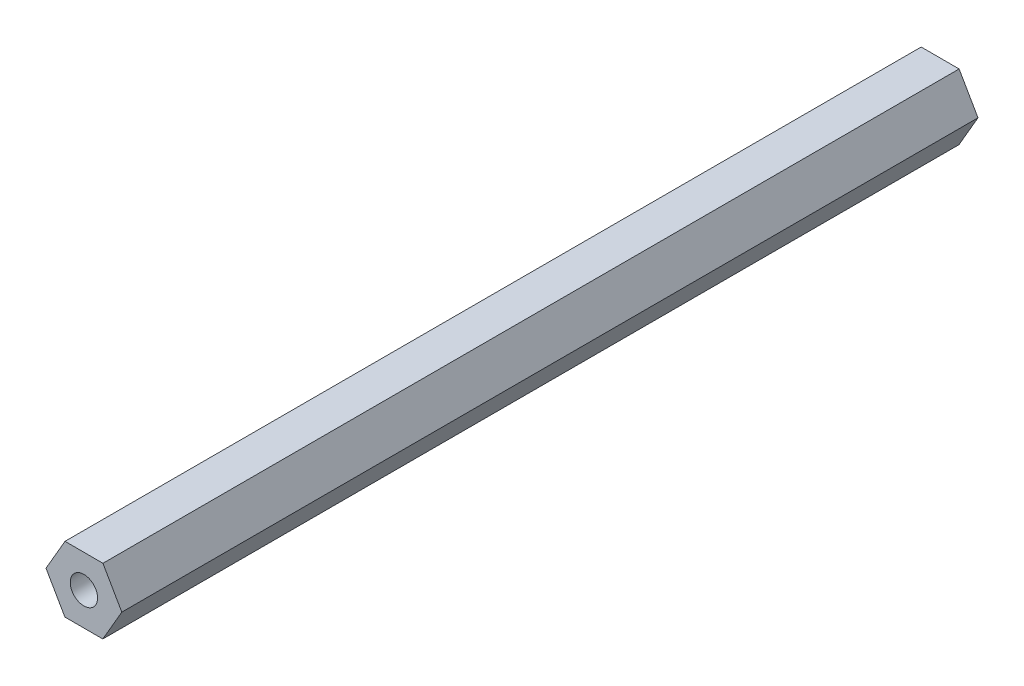
ISO-10303-21;
HEADER;
FILE_DESCRIPTION(('STEP AP214'),'2;1');
FILE_NAME('part.step','',(''),(''),'','','');
FILE_SCHEMA(('AUTOMOTIVE_DESIGN { 1 0 10303 214 1 1 1 1 }'));
ENDSEC;
DATA;
#1=APPLICATION_CONTEXT('core data for automotive mechanical design processes');
#2=APPLICATION_PROTOCOL_DEFINITION('international standard','automotive_design',2000,#1);
#3=PRODUCT_CONTEXT('',#1,'mechanical');
#4=PRODUCT('Part','Part','',(#3));
#5=PRODUCT_RELATED_PRODUCT_CATEGORY('part','',(#4));
#6=PRODUCT_DEFINITION_FORMATION('','',#4);
#7=PRODUCT_DEFINITION_CONTEXT('part definition',#1,'design');
#8=PRODUCT_DEFINITION('design','',#6,#7);
#9=PRODUCT_DEFINITION_SHAPE('','',#8);
#10=(LENGTH_UNIT() NAMED_UNIT(*) SI_UNIT(.MILLI.,.METRE.));
#11=(NAMED_UNIT(*) PLANE_ANGLE_UNIT() SI_UNIT($,.RADIAN.));
#12=(NAMED_UNIT(*) SI_UNIT($,.STERADIAN.) SOLID_ANGLE_UNIT());
#13=UNCERTAINTY_MEASURE_WITH_UNIT(LENGTH_MEASURE(1.E-05),#10,'distance_accuracy_value','');
#14=(GEOMETRIC_REPRESENTATION_CONTEXT(3) GLOBAL_UNCERTAINTY_ASSIGNED_CONTEXT((#13)) GLOBAL_UNIT_ASSIGNED_CONTEXT((#10,
#11,#12)) REPRESENTATION_CONTEXT('',''));
#15=CARTESIAN_POINT('',(0.,0.,0.));
#16=DIRECTION('',(0.,0.,1.));
#17=DIRECTION('',(1.,0.,0.));
#18=AXIS2_PLACEMENT_3D('',#15,#16,#17);
#19=CARTESIAN_POINT('',(-3.4758056499341,-5.99322743468711,156.5));
#20=DIRECTION('',(0.00195177215035608,0.999998095290923,0.));
#21=DIRECTION('',(-0.999998095290923,0.00195177215035608,0.));
#22=AXIS2_PLACEMENT_3D('',#19,#20,#21);
#23=PLANE('',#22);
#24=DIRECTION('',(0.999998095290923,-0.00195177215035608,0.));
#25=VECTOR('',#24,1.);
#26=CARTESIAN_POINT('',(-3.4758056499341,-5.99322743468711,0.));
#27=LINE('',#26,#25);
#28=CARTESIAN_POINT('',(-3.4758056499341,-5.99322743468711,0.));
#29=VERTEX_POINT('',#28);
#30=CARTESIAN_POINT('',(3.45238438412983,-6.00674970880397,0.));
#31=VERTEX_POINT('',#30);
#32=EDGE_CURVE('E132',#29,#31,#27,.T.);
#33=ORIENTED_EDGE('',*,*,#32,.T.);
#34=DIRECTION('',(0.,0.,-1.));
#35=VECTOR('',#34,1.);
#36=CARTESIAN_POINT('',(3.45238438412983,-6.00674970880397,156.5));
#37=LINE('',#36,#35);
#38=CARTESIAN_POINT('',(3.45238438412983,-6.00674970880397,156.5));
#39=VERTEX_POINT('',#38);
#40=EDGE_CURVE('E11',#39,#31,#37,.T.);
#41=ORIENTED_EDGE('',*,*,#40,.F.);
#42=DIRECTION('',(0.999998095290923,-0.00195177215035608,0.));
#43=VECTOR('',#42,1.);
#44=CARTESIAN_POINT('',(-3.4758056499341,-5.99322743468711,156.5));
#45=LINE('',#44,#43);
#46=CARTESIAN_POINT('',(-3.4758056499341,-5.99322743468711,156.5));
#47=VERTEX_POINT('',#46);
#48=EDGE_CURVE('E143',#47,#39,#45,.T.);
#49=ORIENTED_EDGE('',*,*,#48,.F.);
#50=DIRECTION('',(0.,0.,-1.));
#51=VECTOR('',#50,1.);
#52=CARTESIAN_POINT('',(-3.4758056499341,-5.99322743468711,156.5));
#53=LINE('',#52,#51);
#54=EDGE_CURVE('E128',#47,#29,#53,.T.);
#55=ORIENTED_EDGE('',*,*,#54,.T.);
#56=EDGE_LOOP('',(#33,#41,#49,#55));
#57=FACE_BOUND('',#56,.T.);
#58=ADVANCED_FACE('F45',(#57),#23,.F.);
#59=CARTESIAN_POINT('',(3.45238438412983,-6.00674970880397,156.5));
#60=DIRECTION('',(-0.865047868182813,0.501689331910069,0.));
#61=DIRECTION('',(-0.501689331910069,-0.865047868182813,0.));
#62=AXIS2_PLACEMENT_3D('',#59,#60,#61);
#63=PLANE('',#62);
#64=DIRECTION('',(0.501689331910069,0.865047868182813,0.));
#65=VECTOR('',#64,1.);
#66=CARTESIAN_POINT('',(3.45238438412983,-6.00674970880397,0.));
#67=LINE('',#66,#65);
#68=CARTESIAN_POINT('',(6.92819003406393,-0.0135222741168591,0.));
#69=VERTEX_POINT('',#68);
#70=EDGE_CURVE('E135',#31,#69,#67,.T.);
#71=ORIENTED_EDGE('',*,*,#70,.T.);
#72=DIRECTION('',(0.,0.,-1.));
#73=VECTOR('',#72,1.);
#74=CARTESIAN_POINT('',(6.92819003406393,-0.0135222741168591,156.5));
#75=LINE('',#74,#73);
#76=CARTESIAN_POINT('',(6.92819003406393,-0.0135222741168591,156.5));
#77=VERTEX_POINT('',#76);
#78=EDGE_CURVE('E53',#77,#69,#75,.T.);
#79=ORIENTED_EDGE('',*,*,#78,.F.);
#80=DIRECTION('',(0.501689331910069,0.865047868182813,0.));
#81=VECTOR('',#80,1.);
#82=CARTESIAN_POINT('',(3.45238438412983,-6.00674970880397,156.5));
#83=LINE('',#82,#81);
#84=EDGE_CURVE('E99',#39,#77,#83,.T.);
#85=ORIENTED_EDGE('',*,*,#84,.F.);
#86=ORIENTED_EDGE('',*,*,#40,.T.);
#87=EDGE_LOOP('',(#71,#79,#85,#86));
#88=FACE_BOUND('',#87,.T.);
#89=ADVANCED_FACE('F168',(#88),#63,.F.);
#90=CARTESIAN_POINT('',(6.92819003406393,-0.0135222741168591,156.5));
#91=DIRECTION('',(-0.866999640333169,-0.498308763380854,0.));
#92=DIRECTION('',(0.498308763380854,-0.866999640333169,0.));
#93=AXIS2_PLACEMENT_3D('',#90,#91,#92);
#94=PLANE('',#93);
#95=DIRECTION('',(-0.498308763380854,0.866999640333169,0.));
#96=VECTOR('',#95,1.);
#97=CARTESIAN_POINT('',(6.92819003406393,-0.0135222741168591,0.));
#98=LINE('',#97,#96);
#99=CARTESIAN_POINT('',(3.4758056499341,5.99322743468711,0.));
#100=VERTEX_POINT('',#99);
#101=EDGE_CURVE('E138',#69,#100,#98,.T.);
#102=ORIENTED_EDGE('',*,*,#101,.T.);
#103=DIRECTION('',(0.,0.,-1.));
#104=VECTOR('',#103,1.);
#105=CARTESIAN_POINT('',(3.4758056499341,5.99322743468711,156.5));
#106=LINE('',#105,#104);
#107=CARTESIAN_POINT('',(3.4758056499341,5.99322743468711,156.5));
#108=VERTEX_POINT('',#107);
#109=EDGE_CURVE('E123',#108,#100,#106,.T.);
#110=ORIENTED_EDGE('',*,*,#109,.F.);
#111=DIRECTION('',(-0.498308763380854,0.866999640333169,0.));
#112=VECTOR('',#111,1.);
#113=CARTESIAN_POINT('',(6.92819003406393,-0.0135222741168591,156.5));
#114=LINE('',#113,#112);
#115=EDGE_CURVE('E114',#77,#108,#114,.T.);
#116=ORIENTED_EDGE('',*,*,#115,.F.);
#117=ORIENTED_EDGE('',*,*,#78,.T.);
#118=EDGE_LOOP('',(#102,#110,#116,#117));
#119=FACE_BOUND('',#118,.T.);
#120=ADVANCED_FACE('F149',(#119),#94,.F.);
#121=CARTESIAN_POINT('',(3.4758056499341,5.99322743468711,156.5));
#122=DIRECTION('',(-0.00195177215035595,-0.999998095290923,0.));
#123=DIRECTION('',(0.999998095290923,-0.00195177215035595,0.));
#124=AXIS2_PLACEMENT_3D('',#121,#122,#123);
#125=PLANE('',#124);
#126=DIRECTION('',(-0.999998095290923,0.00195177215035595,0.));
#127=VECTOR('',#126,1.);
#128=CARTESIAN_POINT('',(3.4758056499341,5.99322743468711,0.));
#129=LINE('',#128,#127);
#130=CARTESIAN_POINT('',(-3.45238438412983,6.00674970880396,0.));
#131=VERTEX_POINT('',#130);
#132=EDGE_CURVE('E122',#100,#131,#129,.T.);
#133=ORIENTED_EDGE('',*,*,#132,.T.);
#134=DIRECTION('',(0.,0.,-1.));
#135=VECTOR('',#134,1.);
#136=CARTESIAN_POINT('',(-3.45238438412983,6.00674970880396,156.5));
#137=LINE('',#136,#135);
#138=CARTESIAN_POINT('',(-3.45238438412983,6.00674970880396,156.5));
#139=VERTEX_POINT('',#138);
#140=EDGE_CURVE('E119',#139,#131,#137,.T.);
#141=ORIENTED_EDGE('',*,*,#140,.F.);
#142=DIRECTION('',(-0.999998095290923,0.00195177215035595,0.));
#143=VECTOR('',#142,1.);
#144=CARTESIAN_POINT('',(3.4758056499341,5.99322743468711,156.5));
#145=LINE('',#144,#143);
#146=EDGE_CURVE('E108',#108,#139,#145,.T.);
#147=ORIENTED_EDGE('',*,*,#146,.F.);
#148=ORIENTED_EDGE('',*,*,#109,.T.);
#149=EDGE_LOOP('',(#133,#141,#147,#148));
#150=FACE_BOUND('',#149,.T.);
#151=ADVANCED_FACE('F120',(#150),#125,.F.);
#152=CARTESIAN_POINT('',(-3.45238438412983,6.00674970880396,156.5));
#153=DIRECTION('',(0.865047868182813,-0.501689331910069,0.));
#154=DIRECTION('',(0.501689331910069,0.865047868182813,0.));
#155=AXIS2_PLACEMENT_3D('',#152,#153,#154);
#156=PLANE('',#155);
#157=DIRECTION('',(-0.501689331910069,-0.865047868182813,0.));
#158=VECTOR('',#157,1.);
#159=CARTESIAN_POINT('',(-3.45238438412983,6.00674970880396,0.));
#160=LINE('',#159,#158);
#161=CARTESIAN_POINT('',(-6.92819003406393,0.0135222741168588,0.));
#162=VERTEX_POINT('',#161);
#163=EDGE_CURVE('E85',#131,#162,#160,.T.);
#164=ORIENTED_EDGE('',*,*,#163,.T.);
#165=DIRECTION('',(0.,0.,-1.));
#166=VECTOR('',#165,1.);
#167=CARTESIAN_POINT('',(-6.92819003406393,0.0135222741168588,156.5));
#168=LINE('',#167,#166);
#169=CARTESIAN_POINT('',(-6.92819003406393,0.0135222741168588,156.5));
#170=VERTEX_POINT('',#169);
#171=EDGE_CURVE('E124',#170,#162,#168,.T.);
#172=ORIENTED_EDGE('',*,*,#171,.F.);
#173=DIRECTION('',(-0.501689331910069,-0.865047868182813,0.));
#174=VECTOR('',#173,1.);
#175=CARTESIAN_POINT('',(-3.45238438412983,6.00674970880396,156.5));
#176=LINE('',#175,#174);
#177=EDGE_CURVE('E112',#139,#170,#176,.T.);
#178=ORIENTED_EDGE('',*,*,#177,.F.);
#179=ORIENTED_EDGE('',*,*,#140,.T.);
#180=EDGE_LOOP('',(#164,#172,#178,#179));
#181=FACE_BOUND('',#180,.T.);
#182=ADVANCED_FACE('F126',(#181),#156,.F.);
#183=CARTESIAN_POINT('',(-6.92819003406393,0.0135222741168588,156.5));
#184=DIRECTION('',(0.866999640333169,0.498308763380854,0.));
#185=DIRECTION('',(-0.498308763380854,0.866999640333169,0.));
#186=AXIS2_PLACEMENT_3D('',#183,#184,#185);
#187=PLANE('',#186);
#188=DIRECTION('',(0.498308763380854,-0.866999640333169,0.));
#189=VECTOR('',#188,1.);
#190=CARTESIAN_POINT('',(-6.92819003406393,0.0135222741168588,0.));
#191=LINE('',#190,#189);
#192=EDGE_CURVE('E91',#162,#29,#191,.T.);
#193=ORIENTED_EDGE('',*,*,#192,.T.);
#194=ORIENTED_EDGE('',*,*,#54,.F.);
#195=DIRECTION('',(0.498308763380854,-0.866999640333169,0.));
#196=VECTOR('',#195,1.);
#197=CARTESIAN_POINT('',(-6.92819003406393,0.0135222741168588,156.5));
#198=LINE('',#197,#196);
#199=EDGE_CURVE('E61',#170,#47,#198,.T.);
#200=ORIENTED_EDGE('',*,*,#199,.F.);
#201=ORIENTED_EDGE('',*,*,#171,.T.);
#202=EDGE_LOOP('',(#193,#194,#200,#201));
#203=FACE_BOUND('',#202,.T.);
#204=ADVANCED_FACE('F156',(#203),#187,.F.);
#205=CARTESIAN_POINT('',(3.45238438412983,-6.00674970880397,156.5));
#206=DIRECTION('',(0.,0.,1.));
#207=DIRECTION('',(1.,0.,0.));
#208=AXIS2_PLACEMENT_3D('',#205,#206,#207);
#209=PLANE('',#208);
#210=CARTESIAN_POINT('',(0.,0.,156.5));
#211=DIRECTION('',(0.,0.,1.));
#212=DIRECTION('',(1.,0.,0.));
#213=AXIS2_PLACEMENT_3D('',#210,#211,#212);
#214=CIRCLE('',#213,2.49999999999999);
#215=CARTESIAN_POINT('',(2.49999999999999,0.,156.5));
#216=VERTEX_POINT('',#215);
#217=EDGE_CURVE('E256',#216,#216,#214,.T.);
#218=ORIENTED_EDGE('',*,*,#217,.F.);
#219=EDGE_LOOP('',(#218));
#220=FACE_BOUND('',#219,.T.);
#221=ORIENTED_EDGE('',*,*,#48,.T.);
#222=ORIENTED_EDGE('',*,*,#84,.T.);
#223=ORIENTED_EDGE('',*,*,#115,.T.);
#224=ORIENTED_EDGE('',*,*,#146,.T.);
#225=ORIENTED_EDGE('',*,*,#177,.T.);
#226=ORIENTED_EDGE('',*,*,#199,.T.);
#227=EDGE_LOOP('',(#221,#222,#223,#224,#225,#226));
#228=FACE_BOUND('',#227,.T.);
#229=ADVANCED_FACE('F110',(#220,#228),#209,.T.);
#230=CARTESIAN_POINT('',(3.45238438412983,-6.00674970880397,0.));
#231=DIRECTION('',(0.,0.,1.));
#232=DIRECTION('',(1.,0.,0.));
#233=AXIS2_PLACEMENT_3D('',#230,#231,#232);
#234=PLANE('',#233);
#235=CARTESIAN_POINT('',(0.,0.,0.));
#236=DIRECTION('',(0.,0.,-1.));
#237=DIRECTION('',(-1.,0.,0.));
#238=AXIS2_PLACEMENT_3D('',#235,#236,#237);
#239=CIRCLE('',#238,2.49999999999999);
#240=CARTESIAN_POINT('',(-2.49999999999999,0.,0.));
#241=VERTEX_POINT('',#240);
#242=EDGE_CURVE('E254',#241,#241,#239,.T.);
#243=ORIENTED_EDGE('',*,*,#242,.F.);
#244=EDGE_LOOP('',(#243));
#245=FACE_BOUND('',#244,.T.);
#246=ORIENTED_EDGE('',*,*,#32,.F.);
#247=ORIENTED_EDGE('',*,*,#192,.F.);
#248=ORIENTED_EDGE('',*,*,#163,.F.);
#249=ORIENTED_EDGE('',*,*,#132,.F.);
#250=ORIENTED_EDGE('',*,*,#101,.F.);
#251=ORIENTED_EDGE('',*,*,#70,.F.);
#252=EDGE_LOOP('',(#246,#247,#248,#249,#250,#251));
#253=FACE_BOUND('',#252,.T.);
#254=ADVANCED_FACE('F152',(#245,#253),#234,.F.);
#255=CARTESIAN_POINT('',(0.,0.,139.5));
#256=DIRECTION('',(0.,0.,1.));
#257=DIRECTION('',(1.,0.,0.));
#258=AXIS2_PLACEMENT_3D('',#255,#256,#257);
#259=CONICAL_SURFACE('',#258,2.49999999999999,1.02974425867665);
#260=CARTESIAN_POINT('',(0.,0.,137.997848452431));
#261=VERTEX_POINT('',#260);
#262=VERTEX_LOOP('',#261);
#263=FACE_BOUND('',#262,.T.);
#264=CARTESIAN_POINT('',(0.,0.,139.5));
#265=DIRECTION('',(0.,0.,1.));
#266=DIRECTION('',(1.,0.,0.));
#267=AXIS2_PLACEMENT_3D('',#264,#265,#266);
#268=CIRCLE('',#267,2.49999999999999);
#269=CARTESIAN_POINT('',(2.49999999999999,0.,139.5));
#270=VERTEX_POINT('',#269);
#271=EDGE_CURVE('E136',#270,#270,#268,.T.);
#272=ORIENTED_EDGE('',*,*,#271,.T.);
#273=EDGE_LOOP('',(#272));
#274=FACE_BOUND('',#273,.T.);
#275=ADVANCED_FACE('F200',(#263,#274),#259,.F.);
#276=CARTESIAN_POINT('',(0.,0.,156.5));
#277=DIRECTION('',(0.,0.,1.));
#278=DIRECTION('',(1.,0.,0.));
#279=AXIS2_PLACEMENT_3D('',#276,#277,#278);
#280=CYLINDRICAL_SURFACE('',#279,2.49999999999999);
#281=ORIENTED_EDGE('',*,*,#271,.F.);
#282=EDGE_LOOP('',(#281));
#283=FACE_BOUND('',#282,.T.);
#284=ORIENTED_EDGE('',*,*,#217,.T.);
#285=EDGE_LOOP('',(#284));
#286=FACE_BOUND('',#285,.T.);
#287=ADVANCED_FACE('F208',(#283,#286),#280,.F.);
#288=CARTESIAN_POINT('',(0.,0.,17.));
#289=DIRECTION('',(0.,0.,-1.));
#290=DIRECTION('',(-1.,0.,0.));
#291=AXIS2_PLACEMENT_3D('',#288,#289,#290);
#292=CONICAL_SURFACE('',#291,2.49999999999999,1.02974425867665);
#293=CARTESIAN_POINT('',(0.,0.,18.5021515475689));
#294=VERTEX_POINT('',#293);
#295=VERTEX_LOOP('',#294);
#296=FACE_BOUND('',#295,.T.);
#297=CARTESIAN_POINT('',(0.,0.,17.));
#298=DIRECTION('',(0.,0.,-1.));
#299=DIRECTION('',(-1.,0.,0.));
#300=AXIS2_PLACEMENT_3D('',#297,#298,#299);
#301=CIRCLE('',#300,2.49999999999999);
#302=CARTESIAN_POINT('',(-2.49999999999999,0.,17.));
#303=VERTEX_POINT('',#302);
#304=EDGE_CURVE('E251',#303,#303,#301,.T.);
#305=ORIENTED_EDGE('',*,*,#304,.T.);
#306=EDGE_LOOP('',(#305));
#307=FACE_BOUND('',#306,.T.);
#308=ADVANCED_FACE('F216',(#296,#307),#292,.F.);
#309=CARTESIAN_POINT('',(0.,0.,0.));
#310=DIRECTION('',(0.,0.,-1.));
#311=DIRECTION('',(-1.,0.,0.));
#312=AXIS2_PLACEMENT_3D('',#309,#310,#311);
#313=CYLINDRICAL_SURFACE('',#312,2.49999999999999);
#314=ORIENTED_EDGE('',*,*,#304,.F.);
#315=EDGE_LOOP('',(#314));
#316=FACE_BOUND('',#315,.T.);
#317=ORIENTED_EDGE('',*,*,#242,.T.);
#318=EDGE_LOOP('',(#317));
#319=FACE_BOUND('',#318,.T.);
#320=ADVANCED_FACE('F224',(#316,#319),#313,.F.);
#321=CLOSED_SHELL('',(#58,#89,#120,#151,#182,#204,#229,#254,#275,#287,#308,#320));
#322=MANIFOLD_SOLID_BREP('B2',#321);
#323=ADVANCED_BREP_SHAPE_REPRESENTATION('',(#18,#322),#14);
#324=SHAPE_DEFINITION_REPRESENTATION(#9,#323);
ENDSEC;
END-ISO-10303-21;
